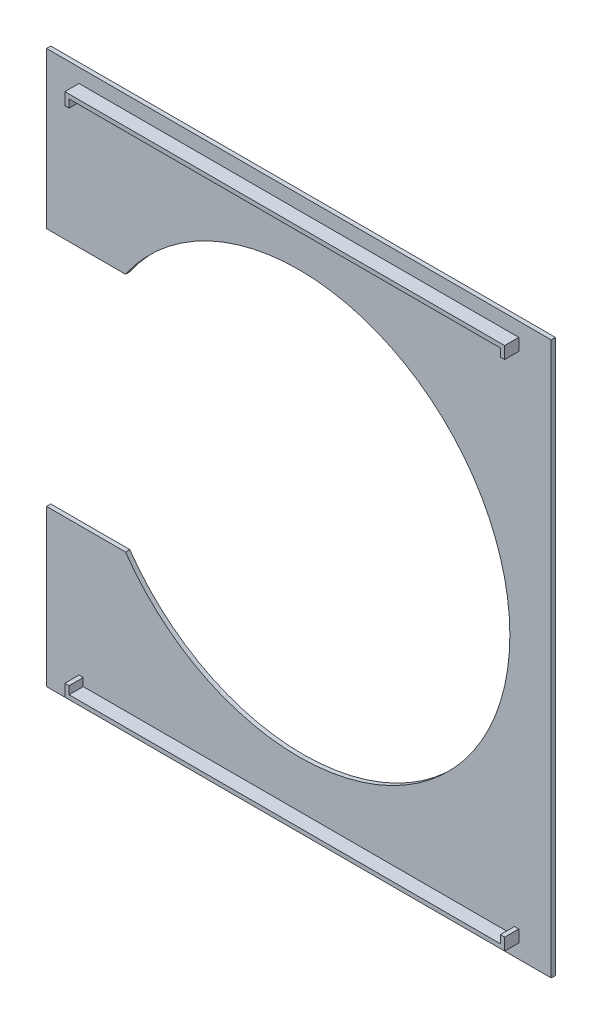
ISO-10303-21;
HEADER;
FILE_DESCRIPTION(('STEP AP214'),'2;1');
FILE_NAME('part.step','',(''),(''),'','','');
FILE_SCHEMA(('AUTOMOTIVE_DESIGN { 1 0 10303 214 1 1 1 1 }'));
ENDSEC;
DATA;
#1=APPLICATION_CONTEXT('core data for automotive mechanical design processes');
#2=APPLICATION_PROTOCOL_DEFINITION('international standard','automotive_design',2000,#1);
#3=PRODUCT_CONTEXT('',#1,'mechanical');
#4=PRODUCT('Part','Part','',(#3));
#5=PRODUCT_RELATED_PRODUCT_CATEGORY('part','',(#4));
#6=PRODUCT_DEFINITION_FORMATION('','',#4);
#7=PRODUCT_DEFINITION_CONTEXT('part definition',#1,'design');
#8=PRODUCT_DEFINITION('design','',#6,#7);
#9=PRODUCT_DEFINITION_SHAPE('','',#8);
#10=(LENGTH_UNIT() NAMED_UNIT(*) SI_UNIT(.MILLI.,.METRE.));
#11=(NAMED_UNIT(*) PLANE_ANGLE_UNIT() SI_UNIT($,.RADIAN.));
#12=(NAMED_UNIT(*) SI_UNIT($,.STERADIAN.) SOLID_ANGLE_UNIT());
#13=UNCERTAINTY_MEASURE_WITH_UNIT(LENGTH_MEASURE(1.E-05),#10,'distance_accuracy_value','');
#14=(GEOMETRIC_REPRESENTATION_CONTEXT(3) GLOBAL_UNCERTAINTY_ASSIGNED_CONTEXT((#13)) GLOBAL_UNIT_ASSIGNED_CONTEXT((#10,
#11,#12)) REPRESENTATION_CONTEXT('',''));
#15=CARTESIAN_POINT('',(0.,0.,0.));
#16=DIRECTION('',(0.,0.,1.));
#17=DIRECTION('',(1.,0.,0.));
#18=AXIS2_PLACEMENT_3D('',#15,#16,#17);
#19=CARTESIAN_POINT('',(0.,0.,-60.5));
#20=DIRECTION('',(0.,0.,1.));
#21=DIRECTION('',(1.,0.,0.));
#22=AXIS2_PLACEMENT_3D('',#19,#20,#21);
#23=PLANE('',#22);
#24=CARTESIAN_POINT('',(0.,0.,-60.5));
#25=DIRECTION('',(0.,0.,1.));
#26=DIRECTION('',(1.,0.,0.));
#27=AXIS2_PLACEMENT_3D('',#24,#25,#26);
#28=CIRCLE('',#27,74.7484752778524);
#29=CARTESIAN_POINT('',(-61.4212874853963,-42.6,-60.5));
#30=VERTEX_POINT('',#29);
#31=CARTESIAN_POINT('',(-61.4212874853963,42.6,-60.5));
#32=VERTEX_POINT('',#31);
#33=EDGE_CURVE('E280',#30,#32,#28,.T.);
#34=ORIENTED_EDGE('',*,*,#33,.F.);
#35=DIRECTION('',(1.,0.,0.));
#36=VECTOR('',#35,1.);
#37=CARTESIAN_POINT('',(-61.4212874853963,-42.6,-60.5));
#38=LINE('',#37,#36);
#39=CARTESIAN_POINT('',(-89.4,-42.6,-60.5));
#40=VERTEX_POINT('',#39);
#41=EDGE_CURVE('E285',#40,#30,#38,.T.);
#42=ORIENTED_EDGE('',*,*,#41,.F.);
#43=DIRECTION('',(0.,1.,0.));
#44=VECTOR('',#43,1.);
#45=CARTESIAN_POINT('',(-89.4,-42.6,-60.5));
#46=LINE('',#45,#44);
#47=CARTESIAN_POINT('',(-89.4,-97.9,-60.5));
#48=VERTEX_POINT('',#47);
#49=EDGE_CURVE('E314',#48,#40,#46,.T.);
#50=ORIENTED_EDGE('',*,*,#49,.F.);
#51=DIRECTION('',(-1.,0.,0.));
#52=VECTOR('',#51,1.);
#53=CARTESIAN_POINT('',(-40.,-97.9,-60.5));
#54=LINE('',#53,#52);
#55=CARTESIAN_POINT('',(89.4,-97.9,-60.5));
#56=VERTEX_POINT('',#55);
#57=EDGE_CURVE('E312',#56,#48,#54,.T.);
#58=ORIENTED_EDGE('',*,*,#57,.F.);
#59=DIRECTION('',(0.,-1.,0.));
#60=VECTOR('',#59,1.);
#61=CARTESIAN_POINT('',(89.4,97.9,-60.5));
#62=LINE('',#61,#60);
#63=CARTESIAN_POINT('',(89.4,97.9,-60.5));
#64=VERTEX_POINT('',#63);
#65=EDGE_CURVE('E309',#64,#56,#62,.T.);
#66=ORIENTED_EDGE('',*,*,#65,.F.);
#67=DIRECTION('',(1.,0.,0.));
#68=VECTOR('',#67,1.);
#69=CARTESIAN_POINT('',(89.4,97.9,-60.5));
#70=LINE('',#69,#68);
#71=CARTESIAN_POINT('',(-89.4,97.9000000000001,-60.5));
#72=VERTEX_POINT('',#71);
#73=EDGE_CURVE('E307',#72,#64,#70,.T.);
#74=ORIENTED_EDGE('',*,*,#73,.F.);
#75=DIRECTION('',(0.,1.,0.));
#76=VECTOR('',#75,1.);
#77=CARTESIAN_POINT('',(-89.4,42.6,-60.5));
#78=LINE('',#77,#76);
#79=CARTESIAN_POINT('',(-89.4,42.6,-60.5));
#80=VERTEX_POINT('',#79);
#81=EDGE_CURVE('E304',#80,#72,#78,.T.);
#82=ORIENTED_EDGE('',*,*,#81,.F.);
#83=DIRECTION('',(-1.,0.,0.));
#84=VECTOR('',#83,1.);
#85=CARTESIAN_POINT('',(-85.9636552055618,42.6,-60.5));
#86=LINE('',#85,#84);
#87=EDGE_CURVE('E302',#32,#80,#86,.T.);
#88=ORIENTED_EDGE('',*,*,#87,.F.);
#89=EDGE_LOOP('',(#34,#42,#50,#58,#66,#74,#82,#88));
#90=FACE_BOUND('',#89,.T.);
#91=DIRECTION('',(1.,0.,0.));
#92=VECTOR('',#91,1.);
#93=CARTESIAN_POINT('',(-76.4,88.6,-60.5));
#94=LINE('',#93,#92);
#95=CARTESIAN_POINT('',(-77.9,88.6,-60.5));
#96=VERTEX_POINT('',#95);
#97=CARTESIAN_POINT('',(-76.4,88.6,-60.5));
#98=VERTEX_POINT('',#97);
#99=EDGE_CURVE('E223',#96,#98,#94,.T.);
#100=ORIENTED_EDGE('',*,*,#99,.F.);
#101=DIRECTION('',(0.,-1.,0.));
#102=VECTOR('',#101,1.);
#103=CARTESIAN_POINT('',(-77.9,92.9,-60.5));
#104=LINE('',#103,#102);
#105=CARTESIAN_POINT('',(-77.9,92.9,-60.5));
#106=VERTEX_POINT('',#105);
#107=EDGE_CURVE('E220',#106,#96,#104,.T.);
#108=ORIENTED_EDGE('',*,*,#107,.F.);
#109=DIRECTION('',(-1.,0.,0.));
#110=VECTOR('',#109,1.);
#111=CARTESIAN_POINT('',(-77.9,92.9,-60.5));
#112=LINE('',#111,#110);
#113=CARTESIAN_POINT('',(77.9,92.9,-60.5));
#114=VERTEX_POINT('',#113);
#115=EDGE_CURVE('E233',#114,#106,#112,.T.);
#116=ORIENTED_EDGE('',*,*,#115,.F.);
#117=DIRECTION('',(0.,1.,0.));
#118=VECTOR('',#117,1.);
#119=CARTESIAN_POINT('',(77.9,92.9,-60.5));
#120=LINE('',#119,#118);
#121=CARTESIAN_POINT('',(77.9,88.6,-60.5));
#122=VERTEX_POINT('',#121);
#123=EDGE_CURVE('E257',#122,#114,#120,.T.);
#124=ORIENTED_EDGE('',*,*,#123,.F.);
#125=DIRECTION('',(1.,0.,0.));
#126=VECTOR('',#125,1.);
#127=CARTESIAN_POINT('',(76.4,88.6,-60.5));
#128=LINE('',#127,#126);
#129=CARTESIAN_POINT('',(76.4,88.6,-60.5));
#130=VERTEX_POINT('',#129);
#131=EDGE_CURVE('E255',#130,#122,#128,.T.);
#132=ORIENTED_EDGE('',*,*,#131,.F.);
#133=DIRECTION('',(0.,-1.,0.));
#134=VECTOR('',#133,1.);
#135=CARTESIAN_POINT('',(76.4,91.4,-60.5));
#136=LINE('',#135,#134);
#137=CARTESIAN_POINT('',(76.4,91.4,-60.5));
#138=VERTEX_POINT('',#137);
#139=EDGE_CURVE('E253',#138,#130,#136,.T.);
#140=ORIENTED_EDGE('',*,*,#139,.F.);
#141=DIRECTION('',(1.,0.,0.));
#142=VECTOR('',#141,1.);
#143=CARTESIAN_POINT('',(-76.4,91.4,-60.5));
#144=LINE('',#143,#142);
#145=CARTESIAN_POINT('',(-76.4,91.4,-60.5));
#146=VERTEX_POINT('',#145);
#147=EDGE_CURVE('E251',#146,#138,#144,.T.);
#148=ORIENTED_EDGE('',*,*,#147,.F.);
#149=DIRECTION('',(0.,1.,0.));
#150=VECTOR('',#149,1.);
#151=CARTESIAN_POINT('',(-76.4,91.4,-60.5));
#152=LINE('',#151,#150);
#153=EDGE_CURVE('E249',#98,#146,#152,.T.);
#154=ORIENTED_EDGE('',*,*,#153,.F.);
#155=EDGE_LOOP('',(#100,#108,#116,#124,#132,#140,#148,#154));
#156=FACE_BOUND('',#155,.T.);
#157=DIRECTION('',(1.,0.,0.));
#158=VECTOR('',#157,1.);
#159=CARTESIAN_POINT('',(-77.9,-92.9,-60.5));
#160=LINE('',#159,#158);
#161=CARTESIAN_POINT('',(-77.9,-92.9,-60.5));
#162=VERTEX_POINT('',#161);
#163=CARTESIAN_POINT('',(77.9000000000001,-92.8999999999999,-60.5));
#164=VERTEX_POINT('',#163);
#165=EDGE_CURVE('E649',#162,#164,#160,.T.);
#166=ORIENTED_EDGE('',*,*,#165,.F.);
#167=DIRECTION('',(0.,-1.,0.));
#168=VECTOR('',#167,1.);
#169=CARTESIAN_POINT('',(-77.9,-88.6,-60.5));
#170=LINE('',#169,#168);
#171=CARTESIAN_POINT('',(-77.9,-88.6,-60.5));
#172=VERTEX_POINT('',#171);
#173=EDGE_CURVE('E218',#172,#162,#170,.T.);
#174=ORIENTED_EDGE('',*,*,#173,.F.);
#175=DIRECTION('',(-1.,0.,0.));
#176=VECTOR('',#175,1.);
#177=CARTESIAN_POINT('',(-76.4,-88.6,-60.5));
#178=LINE('',#177,#176);
#179=CARTESIAN_POINT('',(-76.4,-88.6,-60.5));
#180=VERTEX_POINT('',#179);
#181=EDGE_CURVE('E214',#180,#172,#178,.T.);
#182=ORIENTED_EDGE('',*,*,#181,.F.);
#183=DIRECTION('',(0.,1.,0.));
#184=VECTOR('',#183,1.);
#185=CARTESIAN_POINT('',(-76.4,-91.4,-60.5));
#186=LINE('',#185,#184);
#187=CARTESIAN_POINT('',(-76.4,-91.4,-60.5));
#188=VERTEX_POINT('',#187);
#189=EDGE_CURVE('E645',#188,#180,#186,.T.);
#190=ORIENTED_EDGE('',*,*,#189,.F.);
#191=DIRECTION('',(-1.,0.,0.));
#192=VECTOR('',#191,1.);
#193=CARTESIAN_POINT('',(-76.4,-91.4,-60.5));
#194=LINE('',#193,#192);
#195=CARTESIAN_POINT('',(76.4,-91.4,-60.5));
#196=VERTEX_POINT('',#195);
#197=EDGE_CURVE('E661',#196,#188,#194,.T.);
#198=ORIENTED_EDGE('',*,*,#197,.F.);
#199=DIRECTION('',(0.,-1.,0.));
#200=VECTOR('',#199,1.);
#201=CARTESIAN_POINT('',(76.4,-91.4,-60.5));
#202=LINE('',#201,#200);
#203=CARTESIAN_POINT('',(76.4,-88.6,-60.5));
#204=VERTEX_POINT('',#203);
#205=EDGE_CURVE('E659',#204,#196,#202,.T.);
#206=ORIENTED_EDGE('',*,*,#205,.F.);
#207=DIRECTION('',(-1.,0.,0.));
#208=VECTOR('',#207,1.);
#209=CARTESIAN_POINT('',(76.4,-88.6,-60.5));
#210=LINE('',#209,#208);
#211=CARTESIAN_POINT('',(77.9,-88.6,-60.5));
#212=VERTEX_POINT('',#211);
#213=EDGE_CURVE('E657',#212,#204,#210,.T.);
#214=ORIENTED_EDGE('',*,*,#213,.F.);
#215=DIRECTION('',(0.,1.,0.));
#216=VECTOR('',#215,1.);
#217=CARTESIAN_POINT('',(77.9,-88.6,-60.5));
#218=LINE('',#217,#216);
#219=EDGE_CURVE('E651',#164,#212,#218,.T.);
#220=ORIENTED_EDGE('',*,*,#219,.F.);
#221=EDGE_LOOP('',(#166,#174,#182,#190,#198,#206,#214,#220));
#222=FACE_BOUND('',#221,.T.);
#223=ADVANCED_FACE('F33',(#90,#156,#222),#23,.T.);
#224=CARTESIAN_POINT('',(0.,0.,-62.));
#225=DIRECTION('',(0.,0.,1.));
#226=DIRECTION('',(1.,0.,0.));
#227=AXIS2_PLACEMENT_3D('',#224,#225,#226);
#228=CYLINDRICAL_SURFACE('',#227,74.7484752778524);
#229=ORIENTED_EDGE('',*,*,#33,.T.);
#230=DIRECTION('',(0.,0.,1.));
#231=VECTOR('',#230,1.);
#232=CARTESIAN_POINT('',(-61.4212874853963,42.6,-62.));
#233=LINE('',#232,#231);
#234=CARTESIAN_POINT('',(-61.4212874853963,42.6,-62.));
#235=VERTEX_POINT('',#234);
#236=EDGE_CURVE('E11',#235,#32,#233,.T.);
#237=ORIENTED_EDGE('',*,*,#236,.F.);
#238=CARTESIAN_POINT('',(0.,0.,-62.));
#239=DIRECTION('',(0.,0.,1.));
#240=DIRECTION('',(1.,0.,0.));
#241=AXIS2_PLACEMENT_3D('',#238,#239,#240);
#242=CIRCLE('',#241,74.7484752778524);
#243=CARTESIAN_POINT('',(-61.4212874853963,-42.6,-62.));
#244=VERTEX_POINT('',#243);
#245=EDGE_CURVE('E281',#244,#235,#242,.T.);
#246=ORIENTED_EDGE('',*,*,#245,.F.);
#247=DIRECTION('',(0.,0.,1.));
#248=VECTOR('',#247,1.);
#249=CARTESIAN_POINT('',(-61.4212874853963,-42.6,-62.));
#250=LINE('',#249,#248);
#251=EDGE_CURVE('E299',#244,#30,#250,.T.);
#252=ORIENTED_EDGE('',*,*,#251,.T.);
#253=EDGE_LOOP('',(#229,#237,#246,#252));
#254=FACE_BOUND('',#253,.T.);
#255=ADVANCED_FACE('F35',(#254),#228,.F.);
#256=CARTESIAN_POINT('',(-85.9636552055618,42.6,-62.));
#257=DIRECTION('',(0.,1.,0.));
#258=DIRECTION('',(-1.,0.,0.));
#259=AXIS2_PLACEMENT_3D('',#256,#257,#258);
#260=PLANE('',#259);
#261=ORIENTED_EDGE('',*,*,#87,.T.);
#262=DIRECTION('',(0.,0.,1.));
#263=VECTOR('',#262,1.);
#264=CARTESIAN_POINT('',(-89.4,42.6,-62.));
#265=LINE('',#264,#263);
#266=CARTESIAN_POINT('',(-89.4,42.6,-62.));
#267=VERTEX_POINT('',#266);
#268=EDGE_CURVE('E41',#267,#80,#265,.T.);
#269=ORIENTED_EDGE('',*,*,#268,.F.);
#270=DIRECTION('',(-1.,0.,0.));
#271=VECTOR('',#270,1.);
#272=CARTESIAN_POINT('',(-61.4212874853963,42.6,-62.));
#273=LINE('',#272,#271);
#274=EDGE_CURVE('E284',#235,#267,#273,.T.);
#275=ORIENTED_EDGE('',*,*,#274,.F.);
#276=ORIENTED_EDGE('',*,*,#236,.T.);
#277=EDGE_LOOP('',(#261,#269,#275,#276));
#278=FACE_BOUND('',#277,.T.);
#279=ADVANCED_FACE('F360',(#278),#260,.F.);
#280=CARTESIAN_POINT('',(-89.4,42.6,-62.));
#281=DIRECTION('',(1.,0.,0.));
#282=DIRECTION('',(0.,0.,-1.));
#283=AXIS2_PLACEMENT_3D('',#280,#281,#282);
#284=PLANE('',#283);
#285=ORIENTED_EDGE('',*,*,#81,.T.);
#286=DIRECTION('',(0.,0.,1.));
#287=VECTOR('',#286,1.);
#288=CARTESIAN_POINT('',(-89.4,97.9000000000001,-62.));
#289=LINE('',#288,#287);
#290=CARTESIAN_POINT('',(-89.4,97.9000000000001,-62.));
#291=VERTEX_POINT('',#290);
#292=EDGE_CURVE('E332',#291,#72,#289,.T.);
#293=ORIENTED_EDGE('',*,*,#292,.F.);
#294=DIRECTION('',(0.,1.,0.));
#295=VECTOR('',#294,1.);
#296=CARTESIAN_POINT('',(-89.4,42.6,-62.));
#297=LINE('',#296,#295);
#298=EDGE_CURVE('E287',#267,#291,#297,.T.);
#299=ORIENTED_EDGE('',*,*,#298,.F.);
#300=ORIENTED_EDGE('',*,*,#268,.T.);
#301=EDGE_LOOP('',(#285,#293,#299,#300));
#302=FACE_BOUND('',#301,.T.);
#303=ADVANCED_FACE('F339',(#302),#284,.F.);
#304=CARTESIAN_POINT('',(89.4,97.9,-62.));
#305=DIRECTION('',(0.,-1.,0.));
#306=DIRECTION('',(1.,0.,0.));
#307=AXIS2_PLACEMENT_3D('',#304,#305,#306);
#308=PLANE('',#307);
#309=ORIENTED_EDGE('',*,*,#73,.T.);
#310=DIRECTION('',(0.,0.,1.));
#311=VECTOR('',#310,1.);
#312=CARTESIAN_POINT('',(89.4,97.9,-62.));
#313=LINE('',#312,#311);
#314=CARTESIAN_POINT('',(89.4,97.9,-62.));
#315=VERTEX_POINT('',#314);
#316=EDGE_CURVE('E329',#315,#64,#313,.T.);
#317=ORIENTED_EDGE('',*,*,#316,.F.);
#318=DIRECTION('',(1.,0.,0.));
#319=VECTOR('',#318,1.);
#320=CARTESIAN_POINT('',(-89.4,97.9000000000001,-62.));
#321=LINE('',#320,#319);
#322=EDGE_CURVE('E289',#291,#315,#321,.T.);
#323=ORIENTED_EDGE('',*,*,#322,.F.);
#324=ORIENTED_EDGE('',*,*,#292,.T.);
#325=EDGE_LOOP('',(#309,#317,#323,#324));
#326=FACE_BOUND('',#325,.T.);
#327=ADVANCED_FACE('F348',(#326),#308,.F.);
#328=CARTESIAN_POINT('',(89.4,97.9,-62.));
#329=DIRECTION('',(-1.,0.,0.));
#330=DIRECTION('',(0.,-1.,0.));
#331=AXIS2_PLACEMENT_3D('',#328,#329,#330);
#332=PLANE('',#331);
#333=ORIENTED_EDGE('',*,*,#65,.T.);
#334=DIRECTION('',(0.,0.,1.));
#335=VECTOR('',#334,1.);
#336=CARTESIAN_POINT('',(89.4,-97.9,-62.));
#337=LINE('',#336,#335);
#338=CARTESIAN_POINT('',(89.4,-97.9,-62.));
#339=VERTEX_POINT('',#338);
#340=EDGE_CURVE('E326',#339,#56,#337,.T.);
#341=ORIENTED_EDGE('',*,*,#340,.F.);
#342=DIRECTION('',(0.,-1.,0.));
#343=VECTOR('',#342,1.);
#344=CARTESIAN_POINT('',(89.4,97.9,-62.));
#345=LINE('',#344,#343);
#346=EDGE_CURVE('E291',#315,#339,#345,.T.);
#347=ORIENTED_EDGE('',*,*,#346,.F.);
#348=ORIENTED_EDGE('',*,*,#316,.T.);
#349=EDGE_LOOP('',(#333,#341,#347,#348));
#350=FACE_BOUND('',#349,.T.);
#351=ADVANCED_FACE('F352',(#350),#332,.F.);
#352=CARTESIAN_POINT('',(-40.,-97.9,-62.));
#353=DIRECTION('',(0.,1.,0.));
#354=DIRECTION('',(0.,0.,1.));
#355=AXIS2_PLACEMENT_3D('',#352,#353,#354);
#356=PLANE('',#355);
#357=ORIENTED_EDGE('',*,*,#57,.T.);
#358=DIRECTION('',(0.,0.,1.));
#359=VECTOR('',#358,1.);
#360=CARTESIAN_POINT('',(-89.4,-97.9,-62.));
#361=LINE('',#360,#359);
#362=CARTESIAN_POINT('',(-89.4,-97.9,-62.));
#363=VERTEX_POINT('',#362);
#364=EDGE_CURVE('E323',#363,#48,#361,.T.);
#365=ORIENTED_EDGE('',*,*,#364,.F.);
#366=DIRECTION('',(-1.,0.,0.));
#367=VECTOR('',#366,1.);
#368=CARTESIAN_POINT('',(-40.,-97.9,-62.));
#369=LINE('',#368,#367);
#370=EDGE_CURVE('E293',#339,#363,#369,.T.);
#371=ORIENTED_EDGE('',*,*,#370,.F.);
#372=ORIENTED_EDGE('',*,*,#340,.T.);
#373=EDGE_LOOP('',(#357,#365,#371,#372));
#374=FACE_BOUND('',#373,.T.);
#375=ADVANCED_FACE('F379',(#374),#356,.F.);
#376=CARTESIAN_POINT('',(-89.4,-42.6,-62.));
#377=DIRECTION('',(1.,0.,0.));
#378=DIRECTION('',(0.,0.,-1.));
#379=AXIS2_PLACEMENT_3D('',#376,#377,#378);
#380=PLANE('',#379);
#381=ORIENTED_EDGE('',*,*,#49,.T.);
#382=DIRECTION('',(0.,0.,1.));
#383=VECTOR('',#382,1.);
#384=CARTESIAN_POINT('',(-89.4,-42.6,-62.));
#385=LINE('',#384,#383);
#386=CARTESIAN_POINT('',(-89.4,-42.6,-62.));
#387=VERTEX_POINT('',#386);
#388=EDGE_CURVE('E320',#387,#40,#385,.T.);
#389=ORIENTED_EDGE('',*,*,#388,.F.);
#390=DIRECTION('',(0.,1.,0.));
#391=VECTOR('',#390,1.);
#392=CARTESIAN_POINT('',(-89.4,-42.6,-62.));
#393=LINE('',#392,#391);
#394=EDGE_CURVE('E295',#363,#387,#393,.T.);
#395=ORIENTED_EDGE('',*,*,#394,.F.);
#396=ORIENTED_EDGE('',*,*,#364,.T.);
#397=EDGE_LOOP('',(#381,#389,#395,#396));
#398=FACE_BOUND('',#397,.T.);
#399=ADVANCED_FACE('F367',(#398),#380,.F.);
#400=CARTESIAN_POINT('',(-61.4212874853963,-42.6,-62.));
#401=DIRECTION('',(0.,-1.,0.));
#402=DIRECTION('',(1.,0.,0.));
#403=AXIS2_PLACEMENT_3D('',#400,#401,#402);
#404=PLANE('',#403);
#405=ORIENTED_EDGE('',*,*,#41,.T.);
#406=ORIENTED_EDGE('',*,*,#251,.F.);
#407=DIRECTION('',(1.,0.,0.));
#408=VECTOR('',#407,1.);
#409=CARTESIAN_POINT('',(-85.9636552055618,-42.6,-62.));
#410=LINE('',#409,#408);
#411=EDGE_CURVE('E297',#387,#244,#410,.T.);
#412=ORIENTED_EDGE('',*,*,#411,.F.);
#413=ORIENTED_EDGE('',*,*,#388,.T.);
#414=EDGE_LOOP('',(#405,#406,#412,#413));
#415=FACE_BOUND('',#414,.T.);
#416=ADVANCED_FACE('F370',(#415),#404,.F.);
#417=CARTESIAN_POINT('',(0.,0.,-62.));
#418=DIRECTION('',(0.,0.,1.));
#419=DIRECTION('',(1.,0.,0.));
#420=AXIS2_PLACEMENT_3D('',#417,#418,#419);
#421=PLANE('',#420);
#422=ORIENTED_EDGE('',*,*,#245,.T.);
#423=ORIENTED_EDGE('',*,*,#274,.T.);
#424=ORIENTED_EDGE('',*,*,#298,.T.);
#425=ORIENTED_EDGE('',*,*,#322,.T.);
#426=ORIENTED_EDGE('',*,*,#346,.T.);
#427=ORIENTED_EDGE('',*,*,#370,.T.);
#428=ORIENTED_EDGE('',*,*,#394,.T.);
#429=ORIENTED_EDGE('',*,*,#411,.T.);
#430=EDGE_LOOP('',(#422,#423,#424,#425,#426,#427,#428,#429));
#431=FACE_BOUND('',#430,.T.);
#432=ADVANCED_FACE('F356',(#431),#421,.F.);
#433=CARTESIAN_POINT('',(-77.9,92.9,-55.5));
#434=DIRECTION('',(1.,0.,0.));
#435=DIRECTION('',(0.,0.,-1.));
#436=AXIS2_PLACEMENT_3D('',#433,#434,#435);
#437=PLANE('',#436);
#438=ORIENTED_EDGE('',*,*,#107,.T.);
#439=DIRECTION('',(0.,0.,-1.));
#440=VECTOR('',#439,1.);
#441=CARTESIAN_POINT('',(-77.9,88.6,-55.5));
#442=LINE('',#441,#440);
#443=CARTESIAN_POINT('',(-77.9,88.6,-55.5));
#444=VERTEX_POINT('',#443);
#445=EDGE_CURVE('E278',#444,#96,#442,.T.);
#446=ORIENTED_EDGE('',*,*,#445,.F.);
#447=DIRECTION('',(0.,-1.,0.));
#448=VECTOR('',#447,1.);
#449=CARTESIAN_POINT('',(-77.9,92.9,-55.5));
#450=LINE('',#449,#448);
#451=CARTESIAN_POINT('',(-77.9,92.9,-55.5));
#452=VERTEX_POINT('',#451);
#453=EDGE_CURVE('E229',#452,#444,#450,.T.);
#454=ORIENTED_EDGE('',*,*,#453,.F.);
#455=DIRECTION('',(0.,0.,-1.));
#456=VECTOR('',#455,1.);
#457=CARTESIAN_POINT('',(-77.9,92.9,-55.5));
#458=LINE('',#457,#456);
#459=EDGE_CURVE('E246',#452,#106,#458,.T.);
#460=ORIENTED_EDGE('',*,*,#459,.T.);
#461=EDGE_LOOP('',(#438,#446,#454,#460));
#462=FACE_BOUND('',#461,.T.);
#463=ADVANCED_FACE('F377',(#462),#437,.F.);
#464=CARTESIAN_POINT('',(-76.4,88.6,-55.5));
#465=DIRECTION('',(0.,1.,0.));
#466=DIRECTION('',(-1.,0.,0.));
#467=AXIS2_PLACEMENT_3D('',#464,#465,#466);
#468=PLANE('',#467);
#469=ORIENTED_EDGE('',*,*,#99,.T.);
#470=DIRECTION('',(0.,0.,-1.));
#471=VECTOR('',#470,1.);
#472=CARTESIAN_POINT('',(-76.4,88.6,-55.5));
#473=LINE('',#472,#471);
#474=CARTESIAN_POINT('',(-76.4,88.6,-55.5));
#475=VERTEX_POINT('',#474);
#476=EDGE_CURVE('E275',#475,#98,#473,.T.);
#477=ORIENTED_EDGE('',*,*,#476,.F.);
#478=DIRECTION('',(1.,0.,0.));
#479=VECTOR('',#478,1.);
#480=CARTESIAN_POINT('',(-76.4,88.6,-55.5));
#481=LINE('',#480,#479);
#482=EDGE_CURVE('E232',#444,#475,#481,.T.);
#483=ORIENTED_EDGE('',*,*,#482,.F.);
#484=ORIENTED_EDGE('',*,*,#445,.T.);
#485=EDGE_LOOP('',(#469,#477,#483,#484));
#486=FACE_BOUND('',#485,.T.);
#487=ADVANCED_FACE('F389',(#486),#468,.F.);
#488=CARTESIAN_POINT('',(-76.4,91.4,-55.5));
#489=DIRECTION('',(-1.,0.,0.));
#490=DIRECTION('',(0.,0.,1.));
#491=AXIS2_PLACEMENT_3D('',#488,#489,#490);
#492=PLANE('',#491);
#493=ORIENTED_EDGE('',*,*,#153,.T.);
#494=DIRECTION('',(0.,0.,-1.));
#495=VECTOR('',#494,1.);
#496=CARTESIAN_POINT('',(-76.4,91.4,-55.5));
#497=LINE('',#496,#495);
#498=CARTESIAN_POINT('',(-76.4,91.4,-55.5));
#499=VERTEX_POINT('',#498);
#500=EDGE_CURVE('E272',#499,#146,#497,.T.);
#501=ORIENTED_EDGE('',*,*,#500,.F.);
#502=DIRECTION('',(0.,1.,0.));
#503=VECTOR('',#502,1.);
#504=CARTESIAN_POINT('',(-76.4,91.4,-55.5));
#505=LINE('',#504,#503);
#506=EDGE_CURVE('E235',#475,#499,#505,.T.);
#507=ORIENTED_EDGE('',*,*,#506,.F.);
#508=ORIENTED_EDGE('',*,*,#476,.T.);
#509=EDGE_LOOP('',(#493,#501,#507,#508));
#510=FACE_BOUND('',#509,.T.);
#511=ADVANCED_FACE('F393',(#510),#492,.F.);
#512=CARTESIAN_POINT('',(-76.4,91.4,-55.5));
#513=DIRECTION('',(0.,1.,0.));
#514=DIRECTION('',(0.,0.,1.));
#515=AXIS2_PLACEMENT_3D('',#512,#513,#514);
#516=PLANE('',#515);
#517=ORIENTED_EDGE('',*,*,#147,.T.);
#518=DIRECTION('',(0.,0.,-1.));
#519=VECTOR('',#518,1.);
#520=CARTESIAN_POINT('',(76.4,91.4,-55.5));
#521=LINE('',#520,#519);
#522=CARTESIAN_POINT('',(76.4,91.4,-55.5));
#523=VERTEX_POINT('',#522);
#524=EDGE_CURVE('E269',#523,#138,#521,.T.);
#525=ORIENTED_EDGE('',*,*,#524,.F.);
#526=DIRECTION('',(1.,0.,0.));
#527=VECTOR('',#526,1.);
#528=CARTESIAN_POINT('',(-76.4,91.4,-55.5));
#529=LINE('',#528,#527);
#530=EDGE_CURVE('E237',#499,#523,#529,.T.);
#531=ORIENTED_EDGE('',*,*,#530,.F.);
#532=ORIENTED_EDGE('',*,*,#500,.T.);
#533=EDGE_LOOP('',(#517,#525,#531,#532));
#534=FACE_BOUND('',#533,.T.);
#535=ADVANCED_FACE('F397',(#534),#516,.F.);
#536=CARTESIAN_POINT('',(76.4,91.4,-55.5));
#537=DIRECTION('',(1.,0.,0.));
#538=DIRECTION('',(0.,0.,-1.));
#539=AXIS2_PLACEMENT_3D('',#536,#537,#538);
#540=PLANE('',#539);
#541=ORIENTED_EDGE('',*,*,#139,.T.);
#542=DIRECTION('',(0.,0.,-1.));
#543=VECTOR('',#542,1.);
#544=CARTESIAN_POINT('',(76.4,88.6,-55.5));
#545=LINE('',#544,#543);
#546=CARTESIAN_POINT('',(76.4,88.6,-55.5));
#547=VERTEX_POINT('',#546);
#548=EDGE_CURVE('E266',#547,#130,#545,.T.);
#549=ORIENTED_EDGE('',*,*,#548,.F.);
#550=DIRECTION('',(0.,-1.,0.));
#551=VECTOR('',#550,1.);
#552=CARTESIAN_POINT('',(76.4,91.4,-55.5));
#553=LINE('',#552,#551);
#554=EDGE_CURVE('E239',#523,#547,#553,.T.);
#555=ORIENTED_EDGE('',*,*,#554,.F.);
#556=ORIENTED_EDGE('',*,*,#524,.T.);
#557=EDGE_LOOP('',(#541,#549,#555,#556));
#558=FACE_BOUND('',#557,.T.);
#559=ADVANCED_FACE('F401',(#558),#540,.F.);
#560=CARTESIAN_POINT('',(76.4,88.6,-55.5));
#561=DIRECTION('',(0.,1.,0.));
#562=DIRECTION('',(-1.,0.,0.));
#563=AXIS2_PLACEMENT_3D('',#560,#561,#562);
#564=PLANE('',#563);
#565=ORIENTED_EDGE('',*,*,#131,.T.);
#566=DIRECTION('',(0.,0.,-1.));
#567=VECTOR('',#566,1.);
#568=CARTESIAN_POINT('',(77.9,88.6,-55.5));
#569=LINE('',#568,#567);
#570=CARTESIAN_POINT('',(77.9,88.6,-55.5));
#571=VERTEX_POINT('',#570);
#572=EDGE_CURVE('E263',#571,#122,#569,.T.);
#573=ORIENTED_EDGE('',*,*,#572,.F.);
#574=DIRECTION('',(1.,0.,0.));
#575=VECTOR('',#574,1.);
#576=CARTESIAN_POINT('',(76.4,88.6,-55.5));
#577=LINE('',#576,#575);
#578=EDGE_CURVE('E241',#547,#571,#577,.T.);
#579=ORIENTED_EDGE('',*,*,#578,.F.);
#580=ORIENTED_EDGE('',*,*,#548,.T.);
#581=EDGE_LOOP('',(#565,#573,#579,#580));
#582=FACE_BOUND('',#581,.T.);
#583=ADVANCED_FACE('F405',(#582),#564,.F.);
#584=CARTESIAN_POINT('',(77.9,92.9,-55.5));
#585=DIRECTION('',(-1.,0.,0.));
#586=DIRECTION('',(0.,-1.,0.));
#587=AXIS2_PLACEMENT_3D('',#584,#585,#586);
#588=PLANE('',#587);
#589=ORIENTED_EDGE('',*,*,#123,.T.);
#590=DIRECTION('',(0.,0.,-1.));
#591=VECTOR('',#590,1.);
#592=CARTESIAN_POINT('',(77.9,92.9,-55.5));
#593=LINE('',#592,#591);
#594=CARTESIAN_POINT('',(77.9,92.9,-55.5));
#595=VERTEX_POINT('',#594);
#596=EDGE_CURVE('E56',#595,#114,#593,.T.);
#597=ORIENTED_EDGE('',*,*,#596,.F.);
#598=DIRECTION('',(0.,1.,0.));
#599=VECTOR('',#598,1.);
#600=CARTESIAN_POINT('',(77.9,92.9,-55.5));
#601=LINE('',#600,#599);
#602=EDGE_CURVE('E243',#571,#595,#601,.T.);
#603=ORIENTED_EDGE('',*,*,#602,.F.);
#604=ORIENTED_EDGE('',*,*,#572,.T.);
#605=EDGE_LOOP('',(#589,#597,#603,#604));
#606=FACE_BOUND('',#605,.T.);
#607=ADVANCED_FACE('F409',(#606),#588,.F.);
#608=CARTESIAN_POINT('',(-77.9,92.9,-55.5));
#609=DIRECTION('',(0.,-1.,0.));
#610=DIRECTION('',(0.,0.,-1.));
#611=AXIS2_PLACEMENT_3D('',#608,#609,#610);
#612=PLANE('',#611);
#613=ORIENTED_EDGE('',*,*,#115,.T.);
#614=ORIENTED_EDGE('',*,*,#459,.F.);
#615=DIRECTION('',(-1.,0.,0.));
#616=VECTOR('',#615,1.);
#617=CARTESIAN_POINT('',(-77.9,92.9,-55.5));
#618=LINE('',#617,#616);
#619=EDGE_CURVE('E245',#595,#452,#618,.T.);
#620=ORIENTED_EDGE('',*,*,#619,.F.);
#621=ORIENTED_EDGE('',*,*,#596,.T.);
#622=EDGE_LOOP('',(#613,#614,#620,#621));
#623=FACE_BOUND('',#622,.T.);
#624=ADVANCED_FACE('F413',(#623),#612,.F.);
#625=CARTESIAN_POINT('',(0.,0.,-55.5));
#626=DIRECTION('',(0.,0.,-1.));
#627=DIRECTION('',(-1.,0.,0.));
#628=AXIS2_PLACEMENT_3D('',#625,#626,#627);
#629=PLANE('',#628);
#630=ORIENTED_EDGE('',*,*,#453,.T.);
#631=ORIENTED_EDGE('',*,*,#482,.T.);
#632=ORIENTED_EDGE('',*,*,#506,.T.);
#633=ORIENTED_EDGE('',*,*,#530,.T.);
#634=ORIENTED_EDGE('',*,*,#554,.T.);
#635=ORIENTED_EDGE('',*,*,#578,.T.);
#636=ORIENTED_EDGE('',*,*,#602,.T.);
#637=ORIENTED_EDGE('',*,*,#619,.T.);
#638=EDGE_LOOP('',(#630,#631,#632,#633,#634,#635,#636,#637));
#639=FACE_BOUND('',#638,.T.);
#640=ADVANCED_FACE('F417',(#639),#629,.F.);
#641=CARTESIAN_POINT('',(-77.9,-88.6,-55.5));
#642=DIRECTION('',(1.,0.,0.));
#643=DIRECTION('',(0.,0.,-1.));
#644=AXIS2_PLACEMENT_3D('',#641,#642,#643);
#645=PLANE('',#644);
#646=ORIENTED_EDGE('',*,*,#173,.T.);
#647=DIRECTION('',(0.,0.,-1.));
#648=VECTOR('',#647,1.);
#649=CARTESIAN_POINT('',(-77.9,-92.9,-55.5));
#650=LINE('',#649,#648);
#651=CARTESIAN_POINT('',(-77.9,-92.9,-55.5));
#652=VERTEX_POINT('',#651);
#653=EDGE_CURVE('E199',#652,#162,#650,.T.);
#654=ORIENTED_EDGE('',*,*,#653,.F.);
#655=DIRECTION('',(0.,-1.,0.));
#656=VECTOR('',#655,1.);
#657=CARTESIAN_POINT('',(-77.9,-88.6,-55.5));
#658=LINE('',#657,#656);
#659=CARTESIAN_POINT('',(-77.9,-88.6,-55.5));
#660=VERTEX_POINT('',#659);
#661=EDGE_CURVE('E206',#660,#652,#658,.T.);
#662=ORIENTED_EDGE('',*,*,#661,.F.);
#663=DIRECTION('',(0.,0.,-1.));
#664=VECTOR('',#663,1.);
#665=CARTESIAN_POINT('',(-77.9,-88.6,-55.5));
#666=LINE('',#665,#664);
#667=EDGE_CURVE('E642',#660,#172,#666,.T.);
#668=ORIENTED_EDGE('',*,*,#667,.T.);
#669=EDGE_LOOP('',(#646,#654,#662,#668));
#670=FACE_BOUND('',#669,.T.);
#671=ADVANCED_FACE('F216',(#670),#645,.F.);
#672=CARTESIAN_POINT('',(-77.9,-92.9,-55.5));
#673=DIRECTION('',(0.,1.,0.));
#674=DIRECTION('',(-1.,0.,0.));
#675=AXIS2_PLACEMENT_3D('',#672,#673,#674);
#676=PLANE('',#675);
#677=ORIENTED_EDGE('',*,*,#165,.T.);
#678=DIRECTION('',(0.,0.,-1.));
#679=VECTOR('',#678,1.);
#680=CARTESIAN_POINT('',(77.9000000000001,-92.8999999999999,-55.5));
#681=LINE('',#680,#679);
#682=CARTESIAN_POINT('',(77.9000000000001,-92.8999999999999,-55.5));
#683=VERTEX_POINT('',#682);
#684=EDGE_CURVE('E202',#683,#164,#681,.T.);
#685=ORIENTED_EDGE('',*,*,#684,.F.);
#686=DIRECTION('',(1.,0.,0.));
#687=VECTOR('',#686,1.);
#688=CARTESIAN_POINT('',(-77.9,-92.9,-55.5));
#689=LINE('',#688,#687);
#690=EDGE_CURVE('E195',#652,#683,#689,.T.);
#691=ORIENTED_EDGE('',*,*,#690,.F.);
#692=ORIENTED_EDGE('',*,*,#653,.T.);
#693=EDGE_LOOP('',(#677,#685,#691,#692));
#694=FACE_BOUND('',#693,.T.);
#695=ADVANCED_FACE('F197',(#694),#676,.F.);
#696=CARTESIAN_POINT('',(77.9,-88.6,-55.5));
#697=DIRECTION('',(-1.,0.,0.));
#698=DIRECTION('',(0.,-1.,0.));
#699=AXIS2_PLACEMENT_3D('',#696,#697,#698);
#700=PLANE('',#699);
#701=ORIENTED_EDGE('',*,*,#219,.T.);
#702=DIRECTION('',(0.,0.,-1.));
#703=VECTOR('',#702,1.);
#704=CARTESIAN_POINT('',(77.9,-88.6,-55.5));
#705=LINE('',#704,#703);
#706=CARTESIAN_POINT('',(77.9,-88.6,-55.5));
#707=VERTEX_POINT('',#706);
#708=EDGE_CURVE('E225',#707,#212,#705,.T.);
#709=ORIENTED_EDGE('',*,*,#708,.F.);
#710=DIRECTION('',(0.,1.,0.));
#711=VECTOR('',#710,1.);
#712=CARTESIAN_POINT('',(77.9,-88.6,-55.5));
#713=LINE('',#712,#711);
#714=EDGE_CURVE('E205',#683,#707,#713,.T.);
#715=ORIENTED_EDGE('',*,*,#714,.F.);
#716=ORIENTED_EDGE('',*,*,#684,.T.);
#717=EDGE_LOOP('',(#701,#709,#715,#716));
#718=FACE_BOUND('',#717,.T.);
#719=ADVANCED_FACE('F425',(#718),#700,.F.);
#720=CARTESIAN_POINT('',(76.4,-88.6,-55.5));
#721=DIRECTION('',(0.,-1.,0.));
#722=DIRECTION('',(1.,0.,0.));
#723=AXIS2_PLACEMENT_3D('',#720,#721,#722);
#724=PLANE('',#723);
#725=ORIENTED_EDGE('',*,*,#213,.T.);
#726=DIRECTION('',(0.,0.,-1.));
#727=VECTOR('',#726,1.);
#728=CARTESIAN_POINT('',(76.4,-88.6,-55.5));
#729=LINE('',#728,#727);
#730=CARTESIAN_POINT('',(76.4,-88.6,-55.5));
#731=VERTEX_POINT('',#730);
#732=EDGE_CURVE('E671',#731,#204,#729,.T.);
#733=ORIENTED_EDGE('',*,*,#732,.F.);
#734=DIRECTION('',(-1.,0.,0.));
#735=VECTOR('',#734,1.);
#736=CARTESIAN_POINT('',(76.4,-88.6,-55.5));
#737=LINE('',#736,#735);
#738=EDGE_CURVE('E678',#707,#731,#737,.T.);
#739=ORIENTED_EDGE('',*,*,#738,.F.);
#740=ORIENTED_EDGE('',*,*,#708,.T.);
#741=EDGE_LOOP('',(#725,#733,#739,#740));
#742=FACE_BOUND('',#741,.T.);
#743=ADVANCED_FACE('F428',(#742),#724,.F.);
#744=CARTESIAN_POINT('',(76.4,-91.4,-55.5));
#745=DIRECTION('',(1.,0.,0.));
#746=DIRECTION('',(0.,0.,-1.));
#747=AXIS2_PLACEMENT_3D('',#744,#745,#746);
#748=PLANE('',#747);
#749=ORIENTED_EDGE('',*,*,#205,.T.);
#750=DIRECTION('',(0.,0.,-1.));
#751=VECTOR('',#750,1.);
#752=CARTESIAN_POINT('',(76.4,-91.4,-55.5));
#753=LINE('',#752,#751);
#754=CARTESIAN_POINT('',(76.4,-91.4,-55.5));
#755=VERTEX_POINT('',#754);
#756=EDGE_CURVE('E668',#755,#196,#753,.T.);
#757=ORIENTED_EDGE('',*,*,#756,.F.);
#758=DIRECTION('',(0.,-1.,0.));
#759=VECTOR('',#758,1.);
#760=CARTESIAN_POINT('',(76.4,-91.4,-55.5));
#761=LINE('',#760,#759);
#762=EDGE_CURVE('E688',#731,#755,#761,.T.);
#763=ORIENTED_EDGE('',*,*,#762,.F.);
#764=ORIENTED_EDGE('',*,*,#732,.T.);
#765=EDGE_LOOP('',(#749,#757,#763,#764));
#766=FACE_BOUND('',#765,.T.);
#767=ADVANCED_FACE('F432',(#766),#748,.F.);
#768=CARTESIAN_POINT('',(-76.4,-91.4,-55.5));
#769=DIRECTION('',(0.,-1.,0.));
#770=DIRECTION('',(1.,0.,0.));
#771=AXIS2_PLACEMENT_3D('',#768,#769,#770);
#772=PLANE('',#771);
#773=ORIENTED_EDGE('',*,*,#197,.T.);
#774=DIRECTION('',(0.,0.,-1.));
#775=VECTOR('',#774,1.);
#776=CARTESIAN_POINT('',(-76.4,-91.4,-55.5));
#777=LINE('',#776,#775);
#778=CARTESIAN_POINT('',(-76.4,-91.4,-55.5));
#779=VERTEX_POINT('',#778);
#780=EDGE_CURVE('E665',#779,#188,#777,.T.);
#781=ORIENTED_EDGE('',*,*,#780,.F.);
#782=DIRECTION('',(-1.,0.,0.));
#783=VECTOR('',#782,1.);
#784=CARTESIAN_POINT('',(-76.4,-91.4,-55.5));
#785=LINE('',#784,#783);
#786=EDGE_CURVE('E685',#755,#779,#785,.T.);
#787=ORIENTED_EDGE('',*,*,#786,.F.);
#788=ORIENTED_EDGE('',*,*,#756,.T.);
#789=EDGE_LOOP('',(#773,#781,#787,#788));
#790=FACE_BOUND('',#789,.T.);
#791=ADVANCED_FACE('F436',(#790),#772,.F.);
#792=CARTESIAN_POINT('',(-76.4,-91.4,-55.5));
#793=DIRECTION('',(-1.,0.,0.));
#794=DIRECTION('',(0.,0.,1.));
#795=AXIS2_PLACEMENT_3D('',#792,#793,#794);
#796=PLANE('',#795);
#797=ORIENTED_EDGE('',*,*,#189,.T.);
#798=DIRECTION('',(0.,0.,-1.));
#799=VECTOR('',#798,1.);
#800=CARTESIAN_POINT('',(-76.4,-88.6,-55.5));
#801=LINE('',#800,#799);
#802=CARTESIAN_POINT('',(-76.4,-88.6,-55.5));
#803=VERTEX_POINT('',#802);
#804=EDGE_CURVE('E48',#803,#180,#801,.T.);
#805=ORIENTED_EDGE('',*,*,#804,.F.);
#806=DIRECTION('',(0.,1.,0.));
#807=VECTOR('',#806,1.);
#808=CARTESIAN_POINT('',(-76.4,-91.4,-55.5));
#809=LINE('',#808,#807);
#810=EDGE_CURVE('E687',#779,#803,#809,.T.);
#811=ORIENTED_EDGE('',*,*,#810,.F.);
#812=ORIENTED_EDGE('',*,*,#780,.T.);
#813=EDGE_LOOP('',(#797,#805,#811,#812));
#814=FACE_BOUND('',#813,.T.);
#815=ADVANCED_FACE('F440',(#814),#796,.F.);
#816=CARTESIAN_POINT('',(-76.4,-88.6,-55.5));
#817=DIRECTION('',(0.,-1.,0.));
#818=DIRECTION('',(1.,0.,0.));
#819=AXIS2_PLACEMENT_3D('',#816,#817,#818);
#820=PLANE('',#819);
#821=ORIENTED_EDGE('',*,*,#181,.T.);
#822=ORIENTED_EDGE('',*,*,#667,.F.);
#823=DIRECTION('',(-1.,0.,0.));
#824=VECTOR('',#823,1.);
#825=CARTESIAN_POINT('',(-76.4,-88.6,-55.5));
#826=LINE('',#825,#824);
#827=EDGE_CURVE('E210',#803,#660,#826,.T.);
#828=ORIENTED_EDGE('',*,*,#827,.F.);
#829=ORIENTED_EDGE('',*,*,#804,.T.);
#830=EDGE_LOOP('',(#821,#822,#828,#829));
#831=FACE_BOUND('',#830,.T.);
#832=ADVANCED_FACE('F444',(#831),#820,.F.);
#833=CARTESIAN_POINT('',(0.,0.,-55.5));
#834=DIRECTION('',(0.,0.,1.));
#835=DIRECTION('',(1.,0.,0.));
#836=AXIS2_PLACEMENT_3D('',#833,#834,#835);
#837=PLANE('',#836);
#838=ORIENTED_EDGE('',*,*,#661,.T.);
#839=ORIENTED_EDGE('',*,*,#690,.T.);
#840=ORIENTED_EDGE('',*,*,#714,.T.);
#841=ORIENTED_EDGE('',*,*,#738,.T.);
#842=ORIENTED_EDGE('',*,*,#762,.T.);
#843=ORIENTED_EDGE('',*,*,#786,.T.);
#844=ORIENTED_EDGE('',*,*,#810,.T.);
#845=ORIENTED_EDGE('',*,*,#827,.T.);
#846=EDGE_LOOP('',(#838,#839,#840,#841,#842,#843,#844,#845));
#847=FACE_BOUND('',#846,.T.);
#848=ADVANCED_FACE('F209',(#847),#837,.T.);
#849=CLOSED_SHELL('',(#223,#255,#279,#303,#327,#351,#375,#399,#416,#432,#463,#487,#511,#535,
#559,#583,#607,#624,#640,#671,#695,#719,#743,#767,#791,#815,#832,#848));
#850=MANIFOLD_SOLID_BREP('B2',#849);
#851=ADVANCED_BREP_SHAPE_REPRESENTATION('',(#18,#850),#14);
#852=SHAPE_DEFINITION_REPRESENTATION(#9,#851);
ENDSEC;
END-ISO-10303-21;
